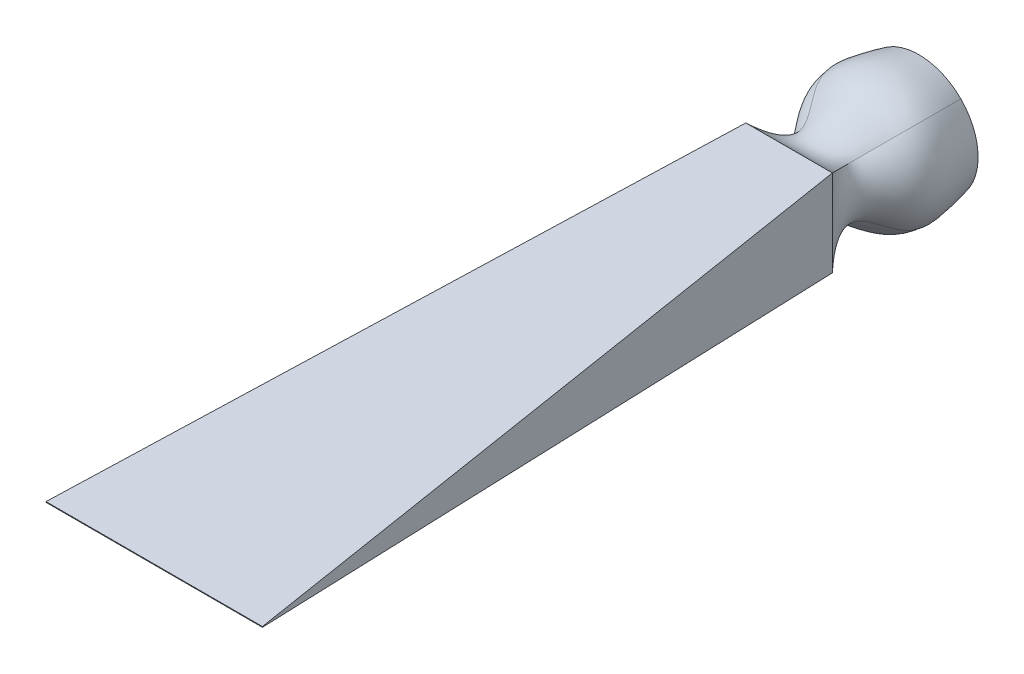
ISO-10303-21;
HEADER;
FILE_DESCRIPTION(('STEP AP214'),'2;1');
FILE_NAME('part.step','',(''),(''),'','','');
FILE_SCHEMA(('AUTOMOTIVE_DESIGN { 1 0 10303 214 1 1 1 1 }'));
ENDSEC;
DATA;
#1=APPLICATION_CONTEXT('core data for automotive mechanical design processes');
#2=APPLICATION_PROTOCOL_DEFINITION('international standard','automotive_design',2000,#1);
#3=PRODUCT_CONTEXT('',#1,'mechanical');
#4=PRODUCT('Part','Part','',(#3));
#5=PRODUCT_RELATED_PRODUCT_CATEGORY('part','',(#4));
#6=PRODUCT_DEFINITION_FORMATION('','',#4);
#7=PRODUCT_DEFINITION_CONTEXT('part definition',#1,'design');
#8=PRODUCT_DEFINITION('design','',#6,#7);
#9=PRODUCT_DEFINITION_SHAPE('','',#8);
#10=(LENGTH_UNIT() NAMED_UNIT(*) SI_UNIT(.MILLI.,.METRE.));
#11=(NAMED_UNIT(*) PLANE_ANGLE_UNIT() SI_UNIT($,.RADIAN.));
#12=(NAMED_UNIT(*) SI_UNIT($,.STERADIAN.) SOLID_ANGLE_UNIT());
#13=UNCERTAINTY_MEASURE_WITH_UNIT(LENGTH_MEASURE(1.E-05),#10,'distance_accuracy_value','');
#14=(GEOMETRIC_REPRESENTATION_CONTEXT(3) GLOBAL_UNCERTAINTY_ASSIGNED_CONTEXT((#13)) GLOBAL_UNIT_ASSIGNED_CONTEXT((#10,
#11,#12)) REPRESENTATION_CONTEXT('',''));
#15=CARTESIAN_POINT('',(0.,0.,0.));
#16=DIRECTION('',(0.,0.,1.));
#17=DIRECTION('',(1.,0.,0.));
#18=AXIS2_PLACEMENT_3D('',#15,#16,#17);
#19=CARTESIAN_POINT('',(0.,0.,0.));
#20=DIRECTION('',(0.,0.,1.));
#21=DIRECTION('',(1.,0.,0.));
#22=AXIS2_PLACEMENT_3D('',#19,#20,#21);
#23=PLANE('',#22);
#24=CARTESIAN_POINT('',(0.,0.,0.));
#25=DIRECTION('',(0.,0.,1.));
#26=DIRECTION('',(1.,0.,0.));
#27=AXIS2_PLACEMENT_3D('',#24,#25,#26);
#28=CIRCLE('',#27,20.5);
#29=CARTESIAN_POINT('',(-14.4956890143242,14.4956890143242,0.));
#30=VERTEX_POINT('',#29);
#31=CARTESIAN_POINT('',(-14.4956890143242,-14.4956890143242,0.));
#32=VERTEX_POINT('',#31);
#33=EDGE_CURVE('E137',#30,#32,#28,.T.);
#34=ORIENTED_EDGE('',*,*,#33,.F.);
#35=CARTESIAN_POINT('',(14.4956890143242,14.4956890143242,0.));
#36=VERTEX_POINT('',#35);
#37=EDGE_CURVE('E219',#36,#30,#28,.T.);
#38=ORIENTED_EDGE('',*,*,#37,.F.);
#39=CARTESIAN_POINT('',(14.4956890143242,-14.4956890143242,0.));
#40=VERTEX_POINT('',#39);
#41=EDGE_CURVE('E212',#40,#36,#28,.T.);
#42=ORIENTED_EDGE('',*,*,#41,.F.);
#43=EDGE_CURVE('E134',#32,#40,#28,.T.);
#44=ORIENTED_EDGE('',*,*,#43,.F.);
#45=EDGE_LOOP('',(#34,#38,#42,#44));
#46=FACE_BOUND('',#45,.T.);
#47=ADVANCED_FACE('F71',(#46),#23,.F.);
#48=CARTESIAN_POINT('',(14.4956890143242,-14.4956890143242,0.));
#49=CARTESIAN_POINT('',(15.7725777813847,-15.7725777813847,7.05083699760858));
#50=CARTESIAN_POINT('',(18.092721607457,-18.092721607457,19.2143259238039));
#51=CARTESIAN_POINT('',(6.21274895830297,-6.21274895830297,31.4452378073536));
#52=CARTESIAN_POINT('',(11.1545289703372,-11.1545289703372,40.689697607955));
#53=CARTESIAN_POINT('',(15.,-15.,45.));
#54=CARTESIAN_POINT('',(22.4960773605071,-6.4953006681413,0.));
#55=CARTESIAN_POINT('',(23.7729661275676,-6.92093025716147,7.05083699760858));
#56=CARTESIAN_POINT('',(27.1429358381487,-7.91258655199417,19.2143259238039));
#57=CARTESIAN_POINT('',(12.4547051155961,-3.36871543250771,31.4452378073536));
#58=CARTESIAN_POINT('',(11.1545289703372,-3.71817632344574,40.689697607955));
#59=CARTESIAN_POINT('',(15.,-5.,45.));
#60=CARTESIAN_POINT('',(22.4960773605071,6.49530066814129,0.));
#61=CARTESIAN_POINT('',(23.7729661275677,6.92093025716146,7.05083699760858));
#62=CARTESIAN_POINT('',(27.1429358381487,7.91258655199415,19.2143259238039));
#63=CARTESIAN_POINT('',(12.4547051155961,3.36871543250771,31.4452378073536));
#64=CARTESIAN_POINT('',(11.1545289703372,3.71817632344574,40.689697607955));
#65=CARTESIAN_POINT('',(15.,5.,45.));
#66=CARTESIAN_POINT('',(14.4956890143242,14.4956890143242,0.));
#67=CARTESIAN_POINT('',(15.7725777813847,15.7725777813847,7.05083699760858));
#68=CARTESIAN_POINT('',(18.092721607457,18.092721607457,19.2143259238039));
#69=CARTESIAN_POINT('',(6.21274895830297,6.21274895830297,31.4452378073536));
#70=CARTESIAN_POINT('',(11.1545289703372,11.1545289703372,40.689697607955));
#71=CARTESIAN_POINT('',(15.,15.,45.));
#72=B_SPLINE_SURFACE_WITH_KNOTS('',3,3,((#48,#49,#50,#51,#52,#53),(#54,#55,#56,#57,#58,#59),
(#60,#61,#62,#63,#64,#65),(#66,#67,#68,#69,#70,#71)),.UNSPECIFIED.,.F.,.F.,.F.,(4,4),(4,1,1,4),
(0.,1.),(0.,0.410860756990362,0.707044119428101,1.),.UNSPECIFIED.);
#73=CARTESIAN_POINT('',(14.4956890143242,14.4956890143242,0.));
#74=CARTESIAN_POINT('',(15.7725777813847,15.7725777813847,7.05083699760858));
#75=CARTESIAN_POINT('',(18.092721607457,18.092721607457,19.2143259238039));
#76=CARTESIAN_POINT('',(6.21274895830297,6.21274895830297,31.4452378073536));
#77=CARTESIAN_POINT('',(11.1545289703372,11.1545289703372,40.689697607955));
#78=CARTESIAN_POINT('',(15.,15.,45.));
#79=B_SPLINE_CURVE_WITH_KNOTS('',3,(#73,#74,#75,#76,#77,#78),.UNSPECIFIED.,.F.,.F.,(4,1,1,4),
(0.,0.410860756990362,0.707044119428101,1.),.UNSPECIFIED.);
#80=CARTESIAN_POINT('',(15.,15.,45.));
#81=VERTEX_POINT('',#80);
#82=EDGE_CURVE('E90',#36,#81,#79,.T.);
#83=DIRECTION('',(0.,1.,0.));
#84=VECTOR('',#83,1.);
#85=CARTESIAN_POINT('',(15.,15.,45.));
#86=LINE('',#85,#84);
#87=CARTESIAN_POINT('',(15.,-15.,45.));
#88=VERTEX_POINT('',#87);
#89=EDGE_CURVE('E140',#88,#81,#86,.T.);
#90=CARTESIAN_POINT('',(14.4956890143242,-14.4956890143242,0.));
#91=CARTESIAN_POINT('',(15.7725777813847,-15.7725777813847,7.05083699760858));
#92=CARTESIAN_POINT('',(18.092721607457,-18.092721607457,19.2143259238039));
#93=CARTESIAN_POINT('',(6.21274895830297,-6.21274895830297,31.4452378073536));
#94=CARTESIAN_POINT('',(11.1545289703372,-11.1545289703372,40.689697607955));
#95=CARTESIAN_POINT('',(15.,-15.,45.));
#96=B_SPLINE_CURVE_WITH_KNOTS('',3,(#90,#91,#92,#93,#94,#95),.UNSPECIFIED.,.F.,.F.,(4,1,1,4),
(0.,0.410860756990362,0.707044119428101,1.),.UNSPECIFIED.);
#97=EDGE_CURVE('E129',#88,#40,#96,.F.);
#98=ORIENTED_EDGE('',*,*,#41,.T.);
#99=ORIENTED_EDGE('',*,*,#82,.T.);
#100=ORIENTED_EDGE('',*,*,#89,.F.);
#101=ORIENTED_EDGE('',*,*,#97,.T.);
#102=EDGE_LOOP('',(#98,#99,#100,#101));
#103=FACE_BOUND('',#102,.T.);
#104=ADVANCED_FACE('F142',(#103),#72,.T.);
#105=CARTESIAN_POINT('',(14.4956890143242,14.4956890143242,0.));
#106=CARTESIAN_POINT('',(15.7725777813847,15.7725777813847,7.05083699760858));
#107=CARTESIAN_POINT('',(18.092721607457,18.092721607457,19.2143259238039));
#108=CARTESIAN_POINT('',(6.21274895830297,6.21274895830297,31.4452378073536));
#109=CARTESIAN_POINT('',(11.1545289703372,11.1545289703372,40.689697607955));
#110=CARTESIAN_POINT('',(15.,15.,45.));
#111=CARTESIAN_POINT('',(6.4953006681413,22.4960773605071,0.));
#112=CARTESIAN_POINT('',(6.92093025716147,23.7729661275677,7.05083699760858));
#113=CARTESIAN_POINT('',(7.91258655199417,27.1429358381487,19.2143259238039));
#114=CARTESIAN_POINT('',(3.36871543250771,12.4547051155961,31.4452378073536));
#115=CARTESIAN_POINT('',(3.71817632344574,11.1545289703372,40.689697607955));
#116=CARTESIAN_POINT('',(5.,15.,45.));
#117=CARTESIAN_POINT('',(-6.49530066814129,22.4960773605071,0.));
#118=CARTESIAN_POINT('',(-6.92093025716146,23.7729661275677,7.05083699760858));
#119=CARTESIAN_POINT('',(-7.91258655199416,27.1429358381487,19.2143259238039));
#120=CARTESIAN_POINT('',(-3.36871543250771,12.4547051155961,31.4452378073536));
#121=CARTESIAN_POINT('',(-3.71817632344574,11.1545289703372,40.689697607955));
#122=CARTESIAN_POINT('',(-5.,15.,45.));
#123=CARTESIAN_POINT('',(-14.4956890143242,14.4956890143242,0.));
#124=CARTESIAN_POINT('',(-15.7725777813847,15.7725777813847,7.05083699760858));
#125=CARTESIAN_POINT('',(-18.092721607457,18.092721607457,19.2143259238039));
#126=CARTESIAN_POINT('',(-6.21274895830298,6.21274895830298,31.4452378073536));
#127=CARTESIAN_POINT('',(-11.1545289703372,11.1545289703372,40.689697607955));
#128=CARTESIAN_POINT('',(-15.,15.,45.));
#129=B_SPLINE_SURFACE_WITH_KNOTS('',3,3,((#105,#106,#107,#108,#109,#110),(#111,#112,#113,#114,
#115,#116),(#117,#118,#119,#120,#121,#122),(#123,#124,#125,#126,#127,#128)),.UNSPECIFIED.,.F.,
.F.,.F.,(4,4),(4,1,1,4),(0.,1.),(0.,0.410860756990362,0.707044119428101,1.),.UNSPECIFIED.);
#130=CARTESIAN_POINT('',(-14.4956890143242,14.4956890143242,0.));
#131=CARTESIAN_POINT('',(-15.7725777813847,15.7725777813847,7.05083699760858));
#132=CARTESIAN_POINT('',(-18.092721607457,18.092721607457,19.2143259238039));
#133=CARTESIAN_POINT('',(-6.21274895830298,6.21274895830298,31.4452378073536));
#134=CARTESIAN_POINT('',(-11.1545289703372,11.1545289703372,40.689697607955));
#135=CARTESIAN_POINT('',(-15.,15.,45.));
#136=B_SPLINE_CURVE_WITH_KNOTS('',3,(#130,#131,#132,#133,#134,#135),.UNSPECIFIED.,.F.,.F.,(4,1,
1,4),(0.,0.410860756990362,0.707044119428101,1.),.UNSPECIFIED.);
#137=CARTESIAN_POINT('',(-15.,15.,45.));
#138=VERTEX_POINT('',#137);
#139=EDGE_CURVE('E232',#30,#138,#136,.T.);
#140=DIRECTION('',(-1.,0.,0.));
#141=VECTOR('',#140,1.);
#142=CARTESIAN_POINT('',(-15.,15.,45.));
#143=LINE('',#142,#141);
#144=EDGE_CURVE('E12',#81,#138,#143,.T.);
#145=ORIENTED_EDGE('',*,*,#37,.T.);
#146=ORIENTED_EDGE('',*,*,#139,.T.);
#147=ORIENTED_EDGE('',*,*,#144,.F.);
#148=ORIENTED_EDGE('',*,*,#82,.F.);
#149=EDGE_LOOP('',(#145,#146,#147,#148));
#150=FACE_BOUND('',#149,.T.);
#151=ADVANCED_FACE('F238',(#150),#129,.T.);
#152=CARTESIAN_POINT('',(-14.4956890143242,-14.4956890143242,0.));
#153=CARTESIAN_POINT('',(-15.7725777813847,-15.7725777813847,7.05083699760858));
#154=CARTESIAN_POINT('',(-18.092721607457,-18.092721607457,19.2143259238039));
#155=CARTESIAN_POINT('',(-6.21274895830298,-6.21274895830297,31.4452378073536));
#156=CARTESIAN_POINT('',(-11.1545289703372,-11.1545289703372,40.689697607955));
#157=CARTESIAN_POINT('',(-15.,-15.,45.));
#158=CARTESIAN_POINT('',(-6.4953006681413,-22.4960773605071,0.));
#159=CARTESIAN_POINT('',(-6.92093025716147,-23.7729661275677,7.05083699760858));
#160=CARTESIAN_POINT('',(-7.91258655199417,-27.1429358381487,19.2143259238039));
#161=CARTESIAN_POINT('',(-3.36871543250771,-12.4547051155961,31.4452378073536));
#162=CARTESIAN_POINT('',(-3.71817632344574,-11.1545289703372,40.689697607955));
#163=CARTESIAN_POINT('',(-5.,-15.,45.));
#164=CARTESIAN_POINT('',(6.49530066814129,-22.4960773605071,0.));
#165=CARTESIAN_POINT('',(6.92093025716146,-23.7729661275677,7.05083699760858));
#166=CARTESIAN_POINT('',(7.91258655199416,-27.1429358381487,19.2143259238039));
#167=CARTESIAN_POINT('',(3.36871543250771,-12.4547051155961,31.4452378073536));
#168=CARTESIAN_POINT('',(3.71817632344574,-11.1545289703372,40.689697607955));
#169=CARTESIAN_POINT('',(5.,-15.,45.));
#170=CARTESIAN_POINT('',(14.4956890143242,-14.4956890143242,0.));
#171=CARTESIAN_POINT('',(15.7725777813847,-15.7725777813847,7.05083699760858));
#172=CARTESIAN_POINT('',(18.092721607457,-18.092721607457,19.2143259238039));
#173=CARTESIAN_POINT('',(6.21274895830297,-6.21274895830297,31.4452378073536));
#174=CARTESIAN_POINT('',(11.1545289703372,-11.1545289703372,40.689697607955));
#175=CARTESIAN_POINT('',(15.,-15.,45.));
#176=B_SPLINE_SURFACE_WITH_KNOTS('',3,3,((#152,#153,#154,#155,#156,#157),(#158,#159,#160,#161,
#162,#163),(#164,#165,#166,#167,#168,#169),(#170,#171,#172,#173,#174,#175)),.UNSPECIFIED.,.F.,
.F.,.F.,(4,4),(4,1,1,4),(0.,1.),(0.,0.410860756990362,0.707044119428101,1.),.UNSPECIFIED.);
#177=DIRECTION('',(1.,0.,0.));
#178=VECTOR('',#177,1.);
#179=CARTESIAN_POINT('',(-15.,-15.,45.));
#180=LINE('',#179,#178);
#181=CARTESIAN_POINT('',(-15.,-15.,45.));
#182=VERTEX_POINT('',#181);
#183=EDGE_CURVE('E132',#182,#88,#180,.T.);
#184=CARTESIAN_POINT('',(-14.4956890143242,-14.4956890143242,0.));
#185=CARTESIAN_POINT('',(-15.7725777813847,-15.7725777813847,7.05083699760858));
#186=CARTESIAN_POINT('',(-18.092721607457,-18.092721607457,19.2143259238039));
#187=CARTESIAN_POINT('',(-6.21274895830298,-6.21274895830297,31.4452378073536));
#188=CARTESIAN_POINT('',(-11.1545289703372,-11.1545289703372,40.689697607955));
#189=CARTESIAN_POINT('',(-15.,-15.,45.));
#190=B_SPLINE_CURVE_WITH_KNOTS('',3,(#184,#185,#186,#187,#188,#189),.UNSPECIFIED.,.F.,.F.,(4,1,
1,4),(0.,0.410860756990362,0.707044119428101,1.),.UNSPECIFIED.);
#191=EDGE_CURVE('E145',#32,#182,#190,.T.);
#192=ORIENTED_EDGE('',*,*,#43,.T.);
#193=ORIENTED_EDGE('',*,*,#97,.F.);
#194=ORIENTED_EDGE('',*,*,#183,.F.);
#195=ORIENTED_EDGE('',*,*,#191,.F.);
#196=EDGE_LOOP('',(#192,#193,#194,#195));
#197=FACE_BOUND('',#196,.T.);
#198=ADVANCED_FACE('F130',(#197),#176,.T.);
#199=CARTESIAN_POINT('',(-14.4956890143242,14.4956890143242,0.));
#200=CARTESIAN_POINT('',(-15.7725777813847,15.7725777813847,7.05083699760858));
#201=CARTESIAN_POINT('',(-18.092721607457,18.092721607457,19.2143259238039));
#202=CARTESIAN_POINT('',(-6.21274895830298,6.21274895830298,31.4452378073536));
#203=CARTESIAN_POINT('',(-11.1545289703372,11.1545289703372,40.689697607955));
#204=CARTESIAN_POINT('',(-15.,15.,45.));
#205=CARTESIAN_POINT('',(-22.4960773605071,6.4953006681413,0.));
#206=CARTESIAN_POINT('',(-23.7729661275677,6.92093025716147,7.05083699760858));
#207=CARTESIAN_POINT('',(-27.1429358381487,7.91258655199417,19.2143259238039));
#208=CARTESIAN_POINT('',(-12.4547051155961,3.36871543250771,31.4452378073536));
#209=CARTESIAN_POINT('',(-11.1545289703372,3.71817632344574,40.689697607955));
#210=CARTESIAN_POINT('',(-15.,5.,45.));
#211=CARTESIAN_POINT('',(-22.4960773605071,-6.49530066814129,0.));
#212=CARTESIAN_POINT('',(-23.7729661275677,-6.92093025716146,7.05083699760858));
#213=CARTESIAN_POINT('',(-27.1429358381487,-7.91258655199416,19.2143259238039));
#214=CARTESIAN_POINT('',(-12.4547051155961,-3.36871543250771,31.4452378073536));
#215=CARTESIAN_POINT('',(-11.1545289703372,-3.71817632344574,40.689697607955));
#216=CARTESIAN_POINT('',(-15.,-5.,45.));
#217=CARTESIAN_POINT('',(-14.4956890143242,-14.4956890143242,0.));
#218=CARTESIAN_POINT('',(-15.7725777813847,-15.7725777813847,7.05083699760858));
#219=CARTESIAN_POINT('',(-18.092721607457,-18.092721607457,19.2143259238039));
#220=CARTESIAN_POINT('',(-6.21274895830298,-6.21274895830297,31.4452378073536));
#221=CARTESIAN_POINT('',(-11.1545289703372,-11.1545289703372,40.689697607955));
#222=CARTESIAN_POINT('',(-15.,-15.,45.));
#223=B_SPLINE_SURFACE_WITH_KNOTS('',3,3,((#199,#200,#201,#202,#203,#204),(#205,#206,#207,#208,
#209,#210),(#211,#212,#213,#214,#215,#216),(#217,#218,#219,#220,#221,#222)),.UNSPECIFIED.,.F.,
.F.,.F.,(4,4),(4,1,1,4),(0.,1.),(0.,0.410860756990362,0.707044119428101,1.),.UNSPECIFIED.);
#224=DIRECTION('',(0.,-1.,0.));
#225=VECTOR('',#224,1.);
#226=CARTESIAN_POINT('',(-15.,15.,45.));
#227=LINE('',#226,#225);
#228=EDGE_CURVE('E83',#138,#182,#227,.T.);
#229=ORIENTED_EDGE('',*,*,#33,.T.);
#230=ORIENTED_EDGE('',*,*,#191,.T.);
#231=ORIENTED_EDGE('',*,*,#228,.F.);
#232=ORIENTED_EDGE('',*,*,#139,.F.);
#233=EDGE_LOOP('',(#229,#230,#231,#232));
#234=FACE_BOUND('',#233,.T.);
#235=ADVANCED_FACE('F73',(#234),#223,.T.);
#236=CARTESIAN_POINT('',(0.,0.,265.));
#237=DIRECTION('',(0.,0.,1.));
#238=DIRECTION('',(1.,0.,0.));
#239=AXIS2_PLACEMENT_3D('',#236,#237,#238);
#240=PLANE('',#239);
#241=DIRECTION('',(0.,1.,0.));
#242=VECTOR('',#241,1.);
#243=CARTESIAN_POINT('',(37.4999999999993,0.124999999999998,265.));
#244=LINE('',#243,#242);
#245=CARTESIAN_POINT('',(37.4999999999993,-0.125000000000003,265.));
#246=VERTEX_POINT('',#245);
#247=CARTESIAN_POINT('',(37.4999999999993,0.124999999999998,265.));
#248=VERTEX_POINT('',#247);
#249=EDGE_CURVE('E152',#246,#248,#244,.T.);
#250=ORIENTED_EDGE('',*,*,#249,.T.);
#251=DIRECTION('',(-1.,0.,0.));
#252=VECTOR('',#251,1.);
#253=CARTESIAN_POINT('',(-37.5000000000007,0.124999999999998,265.));
#254=LINE('',#253,#252);
#255=CARTESIAN_POINT('',(-37.5000000000007,0.124999999999998,265.));
#256=VERTEX_POINT('',#255);
#257=EDGE_CURVE('E414',#248,#256,#254,.T.);
#258=ORIENTED_EDGE('',*,*,#257,.T.);
#259=DIRECTION('',(0.,-1.,0.));
#260=VECTOR('',#259,1.);
#261=CARTESIAN_POINT('',(-37.5000000000007,0.124999999999998,265.));
#262=LINE('',#261,#260);
#263=CARTESIAN_POINT('',(-37.5000000000007,-0.125000000000003,265.));
#264=VERTEX_POINT('',#263);
#265=EDGE_CURVE('E417',#256,#264,#262,.T.);
#266=ORIENTED_EDGE('',*,*,#265,.T.);
#267=DIRECTION('',(1.,0.,0.));
#268=VECTOR('',#267,1.);
#269=CARTESIAN_POINT('',(-37.5000000000007,-0.125000000000003,265.));
#270=LINE('',#269,#268);
#271=EDGE_CURVE('E391',#264,#246,#270,.T.);
#272=ORIENTED_EDGE('',*,*,#271,.T.);
#273=EDGE_LOOP('',(#250,#258,#266,#272));
#274=FACE_BOUND('',#273,.T.);
#275=ADVANCED_FACE('F188',(#274),#240,.T.);
#276=CARTESIAN_POINT('',(10.2900958466455,0.,-1.05239616613417));
#277=DIRECTION('',(-0.99481081734183,0.,0.101742015409957));
#278=DIRECTION('',(0.101742015409957,0.,0.99481081734183));
#279=AXIS2_PLACEMENT_3D('',#276,#277,#278);
#280=PLANE('',#279);
#281=DIRECTION('',(0.101512638699469,-0.0671111333624287,0.992568022839282));
#282=VECTOR('',#281,1.);
#283=CARTESIAN_POINT('',(15.,15.,45.));
#284=LINE('',#283,#282);
#285=EDGE_CURVE('E157',#81,#248,#284,.T.);
#286=ORIENTED_EDGE('',*,*,#285,.T.);
#287=ORIENTED_EDGE('',*,*,#249,.F.);
#288=DIRECTION('',(0.101512638699469,0.0671111333624287,0.992568022839282));
#289=VECTOR('',#288,1.);
#290=CARTESIAN_POINT('',(15.,-15.,45.));
#291=LINE('',#290,#289);
#292=EDGE_CURVE('E149',#88,#246,#291,.T.);
#293=ORIENTED_EDGE('',*,*,#292,.F.);
#294=ORIENTED_EDGE('',*,*,#89,.T.);
#295=EDGE_LOOP('',(#286,#287,#293,#294));
#296=FACE_BOUND('',#295,.T.);
#297=ADVANCED_FACE('F150',(#296),#280,.F.);
#298=CARTESIAN_POINT('',(0.,-17.9605053215848,1.21437507572079));
#299=DIRECTION('',(0.,0.997722005685693,-0.0674596128844304));
#300=DIRECTION('',(0.,0.0674596128844304,0.997722005685694));
#301=AXIS2_PLACEMENT_3D('',#298,#299,#300);
#302=PLANE('',#301);
#303=ORIENTED_EDGE('',*,*,#292,.T.);
#304=ORIENTED_EDGE('',*,*,#271,.F.);
#305=DIRECTION('',(-0.101512638699475,0.0671111333624287,0.992568022839281));
#306=VECTOR('',#305,1.);
#307=CARTESIAN_POINT('',(-15.,-15.,45.));
#308=LINE('',#307,#306);
#309=EDGE_CURVE('E162',#182,#264,#308,.T.);
#310=ORIENTED_EDGE('',*,*,#309,.F.);
#311=ORIENTED_EDGE('',*,*,#183,.T.);
#312=EDGE_LOOP('',(#303,#304,#310,#311));
#313=FACE_BOUND('',#312,.T.);
#314=ADVANCED_FACE('F160',(#313),#302,.F.);
#315=CARTESIAN_POINT('',(0.,17.9605053215848,1.21437507572079));
#316=DIRECTION('',(0.,-0.997722005685693,-0.0674596128844304));
#317=DIRECTION('',(0.,0.0674596128844304,-0.997722005685694));
#318=AXIS2_PLACEMENT_3D('',#315,#316,#317);
#319=PLANE('',#318);
#320=DIRECTION('',(-0.101512638699475,-0.0671111333624287,0.992568022839281));
#321=VECTOR('',#320,1.);
#322=CARTESIAN_POINT('',(-15.,15.,45.));
#323=LINE('',#322,#321);
#324=EDGE_CURVE('E156',#138,#256,#323,.T.);
#325=ORIENTED_EDGE('',*,*,#324,.T.);
#326=ORIENTED_EDGE('',*,*,#257,.F.);
#327=ORIENTED_EDGE('',*,*,#285,.F.);
#328=ORIENTED_EDGE('',*,*,#144,.T.);
#329=EDGE_LOOP('',(#325,#326,#327,#328));
#330=FACE_BOUND('',#329,.T.);
#331=ADVANCED_FACE('F351',(#330),#319,.F.);
#332=CARTESIAN_POINT('',(-10.2900958466452,0.,-1.0523961661342));
#333=DIRECTION('',(0.994810817341829,0.,0.101742015409963));
#334=DIRECTION('',(0.101742015409963,0.,-0.99481081734183));
#335=AXIS2_PLACEMENT_3D('',#332,#333,#334);
#336=PLANE('',#335);
#337=ORIENTED_EDGE('',*,*,#309,.T.);
#338=ORIENTED_EDGE('',*,*,#265,.F.);
#339=ORIENTED_EDGE('',*,*,#324,.F.);
#340=ORIENTED_EDGE('',*,*,#228,.T.);
#341=EDGE_LOOP('',(#337,#338,#339,#340));
#342=FACE_BOUND('',#341,.T.);
#343=ADVANCED_FACE('F359',(#342),#336,.F.);
#344=CLOSED_SHELL('',(#47,#104,#151,#198,#235,#275,#297,#314,#331,#343));
#345=MANIFOLD_SOLID_BREP('B2',#344);
#346=ADVANCED_BREP_SHAPE_REPRESENTATION('',(#18,#345),#14);
#347=SHAPE_DEFINITION_REPRESENTATION(#9,#346);
ENDSEC;
END-ISO-10303-21;
